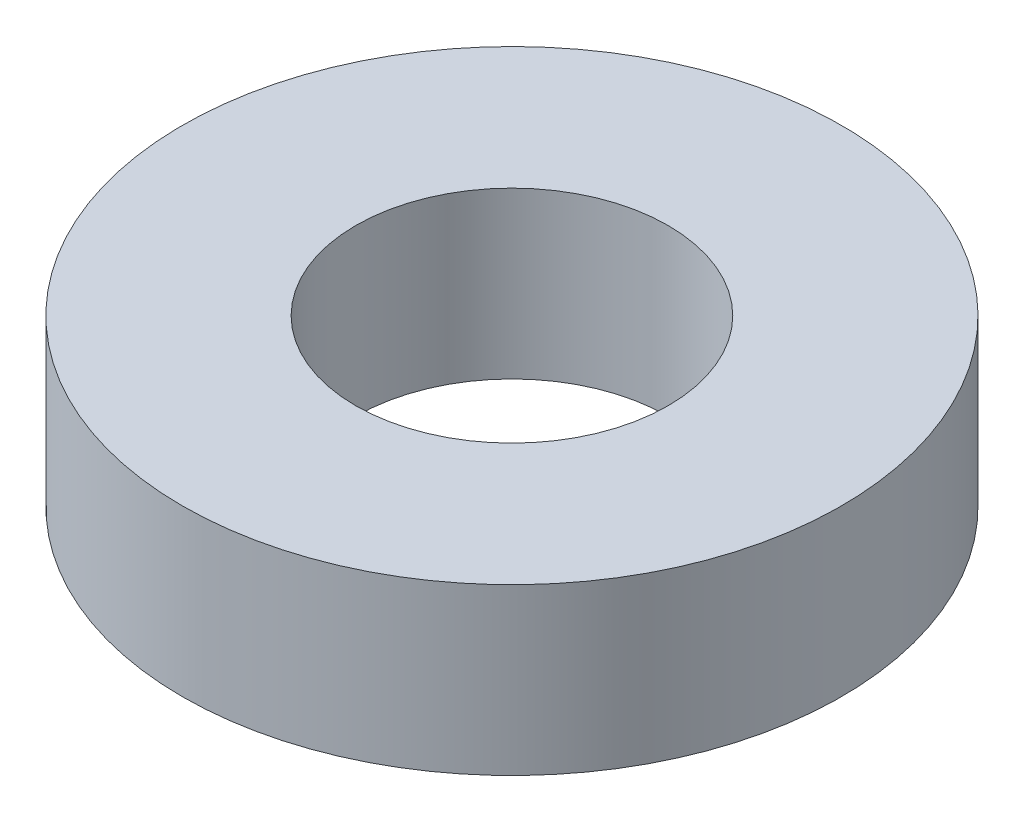
ISO-10303-21;
HEADER;
FILE_DESCRIPTION(('STEP AP214'),'2;1');
FILE_NAME('part.step','',(''),(''),'','','');
FILE_SCHEMA(('AUTOMOTIVE_DESIGN { 1 0 10303 214 1 1 1 1 }'));
ENDSEC;
DATA;
#1=APPLICATION_CONTEXT('core data for automotive mechanical design processes');
#2=APPLICATION_PROTOCOL_DEFINITION('international standard','automotive_design',2000,#1);
#3=PRODUCT_CONTEXT('',#1,'mechanical');
#4=PRODUCT('Part','Part','',(#3));
#5=PRODUCT_RELATED_PRODUCT_CATEGORY('part','',(#4));
#6=PRODUCT_DEFINITION_FORMATION('','',#4);
#7=PRODUCT_DEFINITION_CONTEXT('part definition',#1,'design');
#8=PRODUCT_DEFINITION('design','',#6,#7);
#9=PRODUCT_DEFINITION_SHAPE('','',#8);
#10=(LENGTH_UNIT() NAMED_UNIT(*) SI_UNIT(.MILLI.,.METRE.));
#11=(NAMED_UNIT(*) PLANE_ANGLE_UNIT() SI_UNIT($,.RADIAN.));
#12=(NAMED_UNIT(*) SI_UNIT($,.STERADIAN.) SOLID_ANGLE_UNIT());
#13=UNCERTAINTY_MEASURE_WITH_UNIT(LENGTH_MEASURE(1.E-05),#10,'distance_accuracy_value','');
#14=(GEOMETRIC_REPRESENTATION_CONTEXT(3) GLOBAL_UNCERTAINTY_ASSIGNED_CONTEXT((#13)) GLOBAL_UNIT_ASSIGNED_CONTEXT((#10,
#11,#12)) REPRESENTATION_CONTEXT('',''));
#15=CARTESIAN_POINT('',(0.,0.,0.));
#16=DIRECTION('',(0.,0.,1.));
#17=DIRECTION('',(1.,0.,0.));
#18=AXIS2_PLACEMENT_3D('',#15,#16,#17);
#19=CARTESIAN_POINT('',(4.26360236463624,1.5875,12.605433078055));
#20=DIRECTION('',(0.,-1.,0.));
#21=DIRECTION('',(0.,0.,-1.));
#22=AXIS2_PLACEMENT_3D('',#19,#20,#21);
#23=CYLINDRICAL_SURFACE('',#22,3.16567103668058);
#24=CARTESIAN_POINT('',(4.26360236463624,1.5875,12.605433078055));
#25=DIRECTION('',(0.,1.,0.));
#26=DIRECTION('',(0.,0.,1.));
#27=AXIS2_PLACEMENT_3D('',#24,#25,#26);
#28=CIRCLE('',#27,3.16567103668058);
#29=CARTESIAN_POINT('',(4.26360236463624,1.5875,15.7711041147356));
#30=VERTEX_POINT('',#29);
#31=EDGE_CURVE('E10',#30,#30,#28,.T.);
#32=ORIENTED_EDGE('',*,*,#31,.F.);
#33=EDGE_LOOP('',(#32));
#34=FACE_BOUND('',#33,.T.);
#35=CARTESIAN_POINT('',(4.26360236463624,0.,12.605433078055));
#36=DIRECTION('',(0.,1.,0.));
#37=DIRECTION('',(0.,0.,1.));
#38=AXIS2_PLACEMENT_3D('',#35,#36,#37);
#39=CIRCLE('',#38,3.16567103668058);
#40=CARTESIAN_POINT('',(4.26360236463624,0.,15.7711041147356));
#41=VERTEX_POINT('',#40);
#42=EDGE_CURVE('E37',#41,#41,#39,.T.);
#43=ORIENTED_EDGE('',*,*,#42,.T.);
#44=EDGE_LOOP('',(#43));
#45=FACE_BOUND('',#44,.T.);
#46=ADVANCED_FACE('F30',(#34,#45),#23,.T.);
#47=CARTESIAN_POINT('',(4.26360236463624,1.5875,12.605433078055));
#48=DIRECTION('',(0.,1.,0.));
#49=DIRECTION('',(0.,0.,1.));
#50=AXIS2_PLACEMENT_3D('',#47,#48,#49);
#51=PLANE('',#50);
#52=CARTESIAN_POINT('',(4.26360236463624,1.5875,12.605433078055));
#53=DIRECTION('',(0.,1.,0.));
#54=DIRECTION('',(0.,0.,1.));
#55=AXIS2_PLACEMENT_3D('',#52,#53,#54);
#56=CIRCLE('',#55,1.49999999999999);
#57=CARTESIAN_POINT('',(4.26360236463624,1.5875,14.105433078055));
#58=VERTEX_POINT('',#57);
#59=EDGE_CURVE('E43',#58,#58,#56,.T.);
#60=ORIENTED_EDGE('',*,*,#59,.F.);
#61=EDGE_LOOP('',(#60));
#62=FACE_BOUND('',#61,.T.);
#63=ORIENTED_EDGE('',*,*,#31,.T.);
#64=EDGE_LOOP('',(#63));
#65=FACE_BOUND('',#64,.T.);
#66=ADVANCED_FACE('F59',(#62,#65),#51,.T.);
#67=CARTESIAN_POINT('',(4.26360236463624,0.,12.605433078055));
#68=DIRECTION('',(0.,1.,0.));
#69=DIRECTION('',(0.,0.,1.));
#70=AXIS2_PLACEMENT_3D('',#67,#68,#69);
#71=PLANE('',#70);
#72=CARTESIAN_POINT('',(4.26360236463624,0.,12.605433078055));
#73=DIRECTION('',(0.,1.,0.));
#74=DIRECTION('',(0.,0.,1.));
#75=AXIS2_PLACEMENT_3D('',#72,#73,#74);
#76=CIRCLE('',#75,1.49999999999999);
#77=CARTESIAN_POINT('',(4.26360236463624,0.,14.105433078055));
#78=VERTEX_POINT('',#77);
#79=EDGE_CURVE('E33',#78,#78,#76,.T.);
#80=ORIENTED_EDGE('',*,*,#79,.T.);
#81=EDGE_LOOP('',(#80));
#82=FACE_BOUND('',#81,.T.);
#83=ORIENTED_EDGE('',*,*,#42,.F.);
#84=EDGE_LOOP('',(#83));
#85=FACE_BOUND('',#84,.T.);
#86=ADVANCED_FACE('F50',(#82,#85),#71,.F.);
#87=CARTESIAN_POINT('',(4.26360236463624,1.5875,12.605433078055));
#88=DIRECTION('',(0.,1.,0.));
#89=DIRECTION('',(0.,0.,1.));
#90=AXIS2_PLACEMENT_3D('',#87,#88,#89);
#91=CYLINDRICAL_SURFACE('',#90,1.49999999999999);
#92=ORIENTED_EDGE('',*,*,#59,.T.);
#93=EDGE_LOOP('',(#92));
#94=FACE_BOUND('',#93,.T.);
#95=ORIENTED_EDGE('',*,*,#79,.F.);
#96=EDGE_LOOP('',(#95));
#97=FACE_BOUND('',#96,.T.);
#98=ADVANCED_FACE('F53',(#94,#97),#91,.F.);
#99=CLOSED_SHELL('',(#46,#66,#86,#98));
#100=MANIFOLD_SOLID_BREP('B2',#99);
#101=ADVANCED_BREP_SHAPE_REPRESENTATION('',(#18,#100),#14);
#102=SHAPE_DEFINITION_REPRESENTATION(#9,#101);
ENDSEC;
END-ISO-10303-21;
